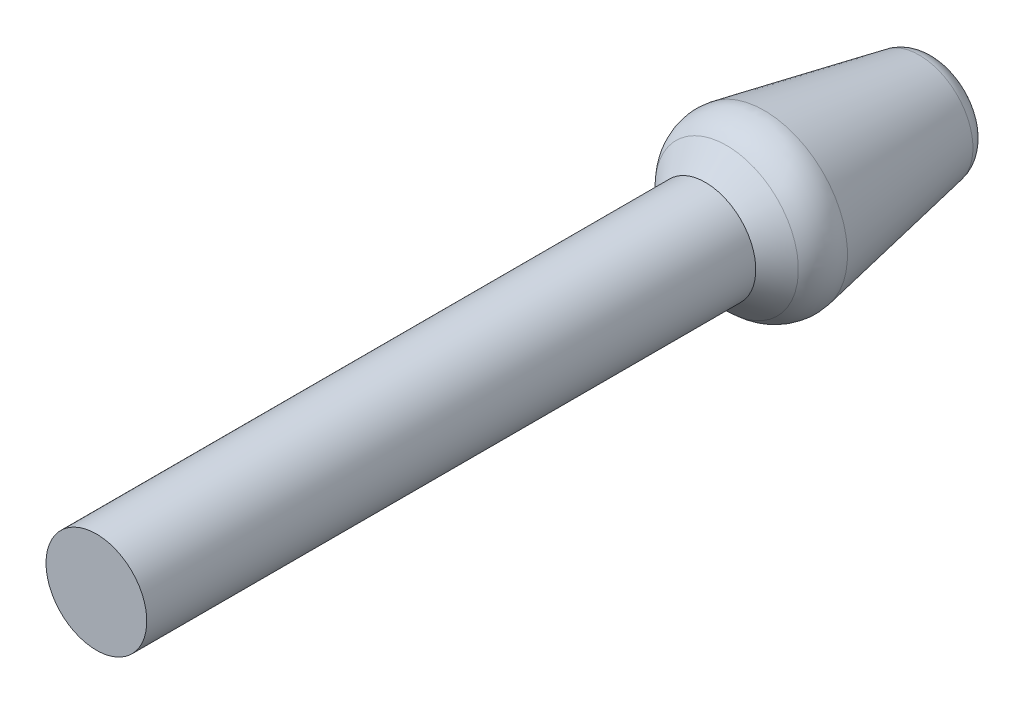
ISO-10303-21;
HEADER;
FILE_DESCRIPTION(('STEP AP214'),'2;1');
FILE_NAME('part.step','',(''),(''),'','','');
FILE_SCHEMA(('AUTOMOTIVE_DESIGN { 1 0 10303 214 1 1 1 1 }'));
ENDSEC;
DATA;
#1=APPLICATION_CONTEXT('core data for automotive mechanical design processes');
#2=APPLICATION_PROTOCOL_DEFINITION('international standard','automotive_design',2000,#1);
#3=PRODUCT_CONTEXT('',#1,'mechanical');
#4=PRODUCT('Part','Part','',(#3));
#5=PRODUCT_RELATED_PRODUCT_CATEGORY('part','',(#4));
#6=PRODUCT_DEFINITION_FORMATION('','',#4);
#7=PRODUCT_DEFINITION_CONTEXT('part definition',#1,'design');
#8=PRODUCT_DEFINITION('design','',#6,#7);
#9=PRODUCT_DEFINITION_SHAPE('','',#8);
#10=(LENGTH_UNIT() NAMED_UNIT(*) SI_UNIT(.MILLI.,.METRE.));
#11=(NAMED_UNIT(*) PLANE_ANGLE_UNIT() SI_UNIT($,.RADIAN.));
#12=(NAMED_UNIT(*) SI_UNIT($,.STERADIAN.) SOLID_ANGLE_UNIT());
#13=UNCERTAINTY_MEASURE_WITH_UNIT(LENGTH_MEASURE(1.E-05),#10,'distance_accuracy_value','');
#14=(GEOMETRIC_REPRESENTATION_CONTEXT(3) GLOBAL_UNCERTAINTY_ASSIGNED_CONTEXT((#13)) GLOBAL_UNIT_ASSIGNED_CONTEXT((#10,
#11,#12)) REPRESENTATION_CONTEXT('',''));
#15=CARTESIAN_POINT('',(0.,0.,0.));
#16=DIRECTION('',(0.,0.,1.));
#17=DIRECTION('',(1.,0.,0.));
#18=AXIS2_PLACEMENT_3D('',#15,#16,#17);
#19=CARTESIAN_POINT('',(-0.991133152501453,0.,-37.9508523224883));
#20=CARTESIAN_POINT('',(-0.991133152501453,-0.991133152501453,-37.9508523224883));
#21=CARTESIAN_POINT('',(0.,-0.991133152501453,-37.9508523224883));
#22=CARTESIAN_POINT('',(0.991133152501453,-0.991133152501453,-37.9508523224883));
#23=CARTESIAN_POINT('',(0.991133152501453,0.,-37.9508523224883));
#24=CARTESIAN_POINT('',(0.991133152501453,0.991133152501453,-37.9508523224883));
#25=CARTESIAN_POINT('',(0.,0.991133152501453,-37.9508523224883));
#26=CARTESIAN_POINT('',(-0.991133152501453,0.991133152501453,-37.9508523224883));
#27=CARTESIAN_POINT('',(-0.991133152501453,0.,-37.9508523224883));
#28=CARTESIAN_POINT('',(-1.0407755681846,0.,-37.6907755681845));
#29=CARTESIAN_POINT('',(-1.0407755681846,-1.0407755681846,-37.6907755681845));
#30=CARTESIAN_POINT('',(0.,-1.0407755681846,-37.6907755681845));
#31=CARTESIAN_POINT('',(1.0407755681846,-1.0407755681846,-37.6907755681845));
#32=CARTESIAN_POINT('',(1.0407755681846,0.,-37.6907755681845));
#33=CARTESIAN_POINT('',(1.0407755681846,1.0407755681846,-37.6907755681845));
#34=CARTESIAN_POINT('',(0.,1.0407755681846,-37.6907755681845));
#35=CARTESIAN_POINT('',(-1.0407755681846,1.0407755681846,-37.6907755681845));
#36=CARTESIAN_POINT('',(-1.0407755681846,0.,-37.6907755681845));
#37=CARTESIAN_POINT('',(-0.853553390593273,0.,-37.5035533905931));
#38=CARTESIAN_POINT('',(-0.853553390593274,-0.853553390593274,-37.5035533905931));
#39=CARTESIAN_POINT('',(0.,-0.853553390593273,-37.5035533905931));
#40=CARTESIAN_POINT('',(0.853553390593274,-0.853553390593274,-37.5035533905931));
#41=CARTESIAN_POINT('',(0.853553390593273,0.,-37.5035533905931));
#42=CARTESIAN_POINT('',(0.853553390593274,0.853553390593274,-37.5035533905931));
#43=CARTESIAN_POINT('',(0.,0.853553390593273,-37.5035533905931));
#44=CARTESIAN_POINT('',(-0.853553390593274,0.853553390593274,-37.5035533905931));
#45=CARTESIAN_POINT('',(-0.853553390593273,0.,-37.5035533905931));
#46=(BOUNDED_SURFACE() B_SPLINE_SURFACE(2,2,((#19,#20,#21,#22,#23,#24,#25,#26,#27),(#28,#29,#30,
#31,#32,#33,#34,#35,#36),(#37,#38,#39,#40,#41,#42,#43,#44,#45)),.UNSPECIFIED.,.F.,.T.,
.F.) B_SPLINE_SURFACE_WITH_KNOTS((3,3),(3,2,2,2,3),(-0.188607307777934,0.78539816339745),
(-3.14159265358979,-1.5707963267949,0.,1.5707963267949,3.14159265358979),
.UNSPECIFIED.) GEOMETRIC_REPRESENTATION_ITEM() RATIONAL_B_SPLINE_SURFACE(((1.,0.707106781186548,
1.,0.707106781186548,1.,0.707106781186548,1.,0.707106781186548,1.),(0.883739483467103,
0.624898181561885,0.883739483467103,0.624898181561885,0.883739483467103,0.624898181561885,
0.883739483467103,0.624898181561885,0.883739483467103),(1.,0.707106781186548,1.,
0.707106781186548,1.,0.707106781186548,1.,0.707106781186548,1.))) REPRESENTATION_ITEM('') SURFACE());
#47=CARTESIAN_POINT('',(0.,0.,-37.5035533905931));
#48=DIRECTION('',(0.,0.,1.));
#49=DIRECTION('',(1.,0.,0.));
#50=AXIS2_PLACEMENT_3D('',#47,#48,#49);
#51=CIRCLE('',#50,0.853553390593273);
#52=CARTESIAN_POINT('',(-0.853553390593273,0.,-37.5035533905931));
#53=VERTEX_POINT('',#52);
#54=EDGE_CURVE('E73',#53,#53,#51,.T.);
#55=CARTESIAN_POINT('',(-0.5,0.,-37.8571067811864));
#56=DIRECTION('',(0.,-1.,0.));
#57=DIRECTION('',(-1.,0.,0.));
#58=AXIS2_PLACEMENT_3D('',#55,#56,#57);
#59=CIRCLE('',#58,0.5);
#60=CARTESIAN_POINT('',(-0.991133152501452,0.,-37.9508523224883));
#61=VERTEX_POINT('',#60);
#62=EDGE_CURVE('E11',#53,#61,#59,.T.);
#63=CARTESIAN_POINT('',(0.,0.,-37.9508523224883));
#64=DIRECTION('',(0.,0.,1.));
#65=DIRECTION('',(1.,0.,0.));
#66=AXIS2_PLACEMENT_3D('',#63,#64,#65);
#67=CIRCLE('',#66,0.991133152501453);
#68=EDGE_CURVE('E21',#61,#61,#67,.T.);
#69=ORIENTED_EDGE('',*,*,#54,.F.);
#70=ORIENTED_EDGE('',*,*,#62,.T.);
#71=ORIENTED_EDGE('',*,*,#68,.T.);
#72=ORIENTED_EDGE('',*,*,#62,.F.);
#73=EDGE_LOOP('',(#69,#70,#71,#72));
#74=FACE_BOUND('',#73,.T.);
#75=ADVANCED_FACE('F17',(#74),#46,.F.);
#76=CARTESIAN_POINT('',(0.,0.,-38.8738625465696));
#77=DIRECTION('',(0.,0.,1.));
#78=DIRECTION('',(1.,0.,0.));
#79=AXIS2_PLACEMENT_3D('',#76,#77,#78);
#80=CONICAL_SURFACE('',#79,0.814952634768153,0.188607307777948);
#81=ORIENTED_EDGE('',*,*,#68,.F.);
#82=DIRECTION('',(0.187491082603802,0.,-0.982266305002902));
#83=VECTOR('',#82,1.);
#84=CARTESIAN_POINT('',(-0.814952634768153,0.,-38.8738625465696));
#85=LINE('',#84,#83);
#86=CARTESIAN_POINT('',(-0.638772117034854,0.,-39.7968727706509));
#87=VERTEX_POINT('',#86);
#88=EDGE_CURVE('E28',#61,#87,#85,.T.);
#89=ORIENTED_EDGE('',*,*,#88,.T.);
#90=CARTESIAN_POINT('',(0.,0.,-39.7968727706509));
#91=DIRECTION('',(0.,0.,1.));
#92=DIRECTION('',(1.,0.,0.));
#93=AXIS2_PLACEMENT_3D('',#90,#91,#92);
#94=CIRCLE('',#93,0.638772117034854);
#95=EDGE_CURVE('E84',#87,#87,#94,.T.);
#96=ORIENTED_EDGE('',*,*,#95,.T.);
#97=ORIENTED_EDGE('',*,*,#88,.F.);
#98=EDGE_LOOP('',(#81,#89,#96,#97));
#99=FACE_BOUND('',#98,.T.);
#100=ADVANCED_FACE('F19',(#99),#80,.T.);
#101=CARTESIAN_POINT('',(0.,0.,-39.75));
#102=DIRECTION('',(0.,0.,1.));
#103=DIRECTION('',(1.,0.,0.));
#104=AXIS2_PLACEMENT_3D('',#101,#102,#103);
#105=TOROIDAL_SURFACE('',#104,0.393205540784129,0.25);
#106=ORIENTED_EDGE('',*,*,#95,.F.);
#107=CARTESIAN_POINT('',(-0.393205540784129,0.,-39.75));
#108=DIRECTION('',(0.,-1.,0.));
#109=DIRECTION('',(-1.,0.,0.));
#110=AXIS2_PLACEMENT_3D('',#107,#108,#109);
#111=CIRCLE('',#110,0.25);
#112=CARTESIAN_POINT('',(-0.393205540784129,0.,-40.));
#113=VERTEX_POINT('',#112);
#114=EDGE_CURVE('E88',#87,#113,#111,.T.);
#115=ORIENTED_EDGE('',*,*,#114,.T.);
#116=CARTESIAN_POINT('',(0.,0.,-40.));
#117=DIRECTION('',(0.,0.,1.));
#118=DIRECTION('',(1.,0.,0.));
#119=AXIS2_PLACEMENT_3D('',#116,#117,#118);
#120=CIRCLE('',#119,0.393205540784129);
#121=EDGE_CURVE('E67',#113,#113,#120,.T.);
#122=ORIENTED_EDGE('',*,*,#121,.T.);
#123=ORIENTED_EDGE('',*,*,#114,.F.);
#124=EDGE_LOOP('',(#106,#115,#122,#123));
#125=FACE_BOUND('',#124,.T.);
#126=ADVANCED_FACE('F104',(#125),#105,.T.);
#127=CARTESIAN_POINT('',(0.393205540784129,0.,-40.));
#128=DIRECTION('',(0.,0.,-1.));
#129=DIRECTION('',(0.,-1.,0.));
#130=AXIS2_PLACEMENT_3D('',#127,#128,#129);
#131=PLANE('',#130);
#132=ORIENTED_EDGE('',*,*,#121,.F.);
#133=EDGE_LOOP('',(#132));
#134=FACE_BOUND('',#133,.T.);
#135=ADVANCED_FACE('F108',(#134),#131,.T.);
#136=CARTESIAN_POINT('',(0.,0.,-30.));
#137=DIRECTION('',(0.,0.,1.));
#138=DIRECTION('',(1.,0.,0.));
#139=AXIS2_PLACEMENT_3D('',#136,#137,#138);
#140=PLANE('',#139);
#141=CARTESIAN_POINT('',(0.,0.,-30.));
#142=DIRECTION('',(0.,0.,1.));
#143=DIRECTION('',(1.,0.,0.));
#144=AXIS2_PLACEMENT_3D('',#141,#142,#143);
#145=CIRCLE('',#144,0.6);
#146=CARTESIAN_POINT('',(-0.6,0.,-30.));
#147=VERTEX_POINT('',#146);
#148=EDGE_CURVE('E65',#147,#147,#145,.T.);
#149=ORIENTED_EDGE('',*,*,#148,.T.);
#150=EDGE_LOOP('',(#149));
#151=FACE_BOUND('',#150,.T.);
#152=ADVANCED_FACE('F110',(#151),#140,.T.);
#153=CARTESIAN_POINT('',(0.,0.,-33.625));
#154=DIRECTION('',(0.,0.,1.));
#155=DIRECTION('',(1.,0.,0.));
#156=AXIS2_PLACEMENT_3D('',#153,#154,#155);
#157=CYLINDRICAL_SURFACE('',#156,0.6);
#158=ORIENTED_EDGE('',*,*,#148,.F.);
#159=DIRECTION('',(0.,0.,-1.));
#160=VECTOR('',#159,1.);
#161=CARTESIAN_POINT('',(-0.6,0.,-33.625));
#162=LINE('',#161,#160);
#163=CARTESIAN_POINT('',(-0.6,0.,-37.25));
#164=VERTEX_POINT('',#163);
#165=EDGE_CURVE('E59',#147,#164,#162,.T.);
#166=ORIENTED_EDGE('',*,*,#165,.T.);
#167=CARTESIAN_POINT('',(0.,0.,-37.25));
#168=DIRECTION('',(0.,0.,1.));
#169=DIRECTION('',(1.,0.,0.));
#170=AXIS2_PLACEMENT_3D('',#167,#168,#169);
#171=CIRCLE('',#170,0.6);
#172=EDGE_CURVE('E63',#164,#164,#171,.T.);
#173=ORIENTED_EDGE('',*,*,#172,.T.);
#174=ORIENTED_EDGE('',*,*,#165,.F.);
#175=EDGE_LOOP('',(#158,#166,#173,#174));
#176=FACE_BOUND('',#175,.T.);
#177=ADVANCED_FACE('F61',(#176),#157,.T.);
#178=CARTESIAN_POINT('',(0.,0.,-37.3767766952966));
#179=DIRECTION('',(0.,0.,-1.));
#180=DIRECTION('',(1.,0.,0.));
#181=AXIS2_PLACEMENT_3D('',#178,#179,#180);
#182=CONICAL_SURFACE('',#181,0.726776695296635,0.785398163397746);
#183=ORIENTED_EDGE('',*,*,#172,.F.);
#184=DIRECTION('',(-0.707106781186758,0.,-0.707106781186337));
#185=VECTOR('',#184,1.);
#186=CARTESIAN_POINT('',(-0.726776695296635,0.,-37.3767766952966));
#187=LINE('',#186,#185);
#188=EDGE_CURVE('E71',#164,#53,#187,.T.);
#189=ORIENTED_EDGE('',*,*,#188,.T.);
#190=ORIENTED_EDGE('',*,*,#54,.T.);
#191=ORIENTED_EDGE('',*,*,#188,.F.);
#192=EDGE_LOOP('',(#183,#189,#190,#191));
#193=FACE_BOUND('',#192,.T.);
#194=ADVANCED_FACE('F72',(#193),#182,.T.);
#195=CLOSED_SHELL('',(#75,#100,#126,#135,#152,#177,#194));
#196=MANIFOLD_SOLID_BREP('B1',#195);
#197=ADVANCED_BREP_SHAPE_REPRESENTATION('',(#18,#196),#14);
#198=SHAPE_DEFINITION_REPRESENTATION(#9,#197);
ENDSEC;
END-ISO-10303-21;
